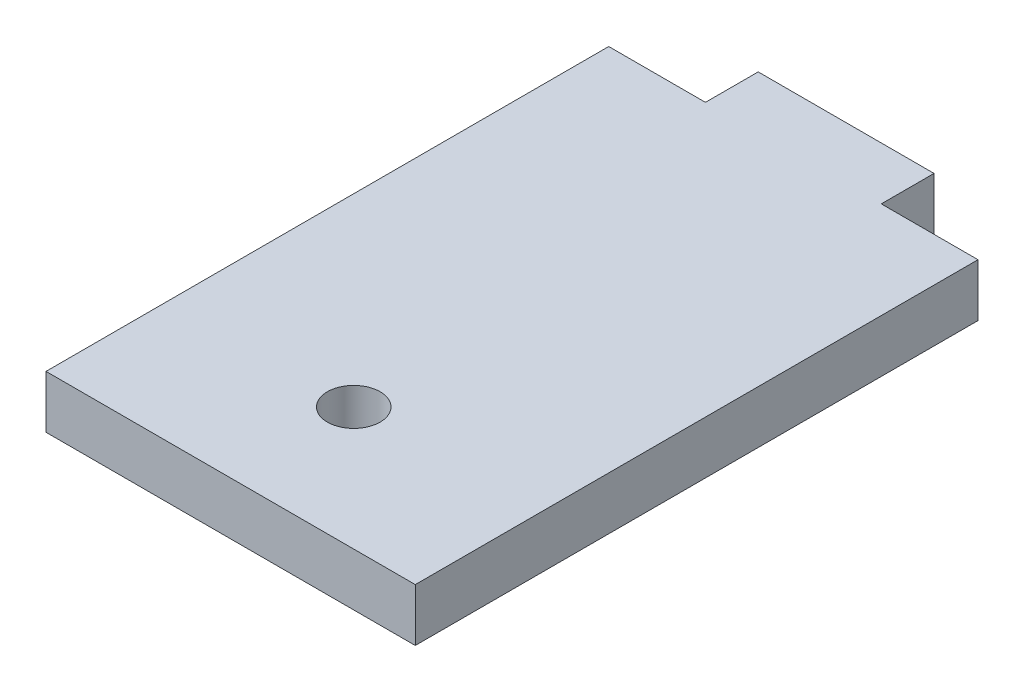
ISO-10303-21;
HEADER;
FILE_DESCRIPTION(('STEP AP214'),'2;1');
FILE_NAME('part.step','',(''),(''),'','','');
FILE_SCHEMA(('AUTOMOTIVE_DESIGN { 1 0 10303 214 1 1 1 1 }'));
ENDSEC;
DATA;
#1=APPLICATION_CONTEXT('core data for automotive mechanical design processes');
#2=APPLICATION_PROTOCOL_DEFINITION('international standard','automotive_design',2000,#1);
#3=PRODUCT_CONTEXT('',#1,'mechanical');
#4=PRODUCT('Part','Part','',(#3));
#5=PRODUCT_RELATED_PRODUCT_CATEGORY('part','',(#4));
#6=PRODUCT_DEFINITION_FORMATION('','',#4);
#7=PRODUCT_DEFINITION_CONTEXT('part definition',#1,'design');
#8=PRODUCT_DEFINITION('design','',#6,#7);
#9=PRODUCT_DEFINITION_SHAPE('','',#8);
#10=(LENGTH_UNIT() NAMED_UNIT(*) SI_UNIT(.MILLI.,.METRE.));
#11=(NAMED_UNIT(*) PLANE_ANGLE_UNIT() SI_UNIT($,.RADIAN.));
#12=(NAMED_UNIT(*) SI_UNIT($,.STERADIAN.) SOLID_ANGLE_UNIT());
#13=UNCERTAINTY_MEASURE_WITH_UNIT(LENGTH_MEASURE(1.E-05),#10,'distance_accuracy_value','');
#14=(GEOMETRIC_REPRESENTATION_CONTEXT(3) GLOBAL_UNCERTAINTY_ASSIGNED_CONTEXT((#13)) GLOBAL_UNIT_ASSIGNED_CONTEXT((#10,
#11,#12)) REPRESENTATION_CONTEXT('',''));
#15=CARTESIAN_POINT('',(0.,0.,0.));
#16=DIRECTION('',(0.,0.,1.));
#17=DIRECTION('',(1.,0.,0.));
#18=AXIS2_PLACEMENT_3D('',#15,#16,#17);
#19=CARTESIAN_POINT('',(0.,3.,0.));
#20=DIRECTION('',(0.,-1.,0.));
#21=DIRECTION('',(0.,0.,-1.));
#22=AXIS2_PLACEMENT_3D('',#19,#20,#21);
#23=PLANE('',#22);
#24=DIRECTION('',(0.,0.,1.));
#25=VECTOR('',#24,1.);
#26=CARTESIAN_POINT('',(0.,3.,3.));
#27=LINE('',#26,#25);
#28=CARTESIAN_POINT('',(0.,3.,0.));
#29=VERTEX_POINT('',#28);
#30=CARTESIAN_POINT('',(0.,3.,3.));
#31=VERTEX_POINT('',#30);
#32=EDGE_CURVE('E164',#29,#31,#27,.T.);
#33=ORIENTED_EDGE('',*,*,#32,.T.);
#34=DIRECTION('',(-1.,0.,0.));
#35=VECTOR('',#34,1.);
#36=CARTESIAN_POINT('',(-5.5,3.,3.));
#37=LINE('',#36,#35);
#38=CARTESIAN_POINT('',(-5.5,3.,3.));
#39=VERTEX_POINT('',#38);
#40=EDGE_CURVE('E100',#31,#39,#37,.T.);
#41=ORIENTED_EDGE('',*,*,#40,.T.);
#42=DIRECTION('',(0.,0.,1.));
#43=VECTOR('',#42,1.);
#44=CARTESIAN_POINT('',(-5.5,3.,35.));
#45=LINE('',#44,#43);
#46=CARTESIAN_POINT('',(-5.5,3.,35.));
#47=VERTEX_POINT('',#46);
#48=EDGE_CURVE('E185',#39,#47,#45,.T.);
#49=ORIENTED_EDGE('',*,*,#48,.T.);
#50=DIRECTION('',(1.,0.,0.));
#51=VECTOR('',#50,1.);
#52=CARTESIAN_POINT('',(15.5,3.,35.));
#53=LINE('',#52,#51);
#54=CARTESIAN_POINT('',(15.5,3.,35.));
#55=VERTEX_POINT('',#54);
#56=EDGE_CURVE('E199',#47,#55,#53,.T.);
#57=ORIENTED_EDGE('',*,*,#56,.T.);
#58=DIRECTION('',(0.,0.,-1.));
#59=VECTOR('',#58,1.);
#60=CARTESIAN_POINT('',(15.5,3.,3.));
#61=LINE('',#60,#59);
#62=CARTESIAN_POINT('',(15.5,3.,3.));
#63=VERTEX_POINT('',#62);
#64=EDGE_CURVE('E119',#55,#63,#61,.T.);
#65=ORIENTED_EDGE('',*,*,#64,.T.);
#66=DIRECTION('',(-1.,0.,0.));
#67=VECTOR('',#66,1.);
#68=CARTESIAN_POINT('',(10.,3.,3.));
#69=LINE('',#68,#67);
#70=CARTESIAN_POINT('',(10.,3.,3.));
#71=VERTEX_POINT('',#70);
#72=EDGE_CURVE('E113',#63,#71,#69,.T.);
#73=ORIENTED_EDGE('',*,*,#72,.T.);
#74=DIRECTION('',(0.,0.,-1.));
#75=VECTOR('',#74,1.);
#76=CARTESIAN_POINT('',(10.,3.,0.));
#77=LINE('',#76,#75);
#78=CARTESIAN_POINT('',(10.,3.,0.));
#79=VERTEX_POINT('',#78);
#80=EDGE_CURVE('E117',#71,#79,#77,.T.);
#81=ORIENTED_EDGE('',*,*,#80,.T.);
#82=DIRECTION('',(-1.,0.,0.));
#83=VECTOR('',#82,1.);
#84=CARTESIAN_POINT('',(0.,3.,0.));
#85=LINE('',#84,#83);
#86=EDGE_CURVE('E57',#79,#29,#85,.T.);
#87=ORIENTED_EDGE('',*,*,#86,.T.);
#88=EDGE_LOOP('',(#33,#41,#49,#57,#65,#73,#81,#87));
#89=FACE_BOUND('',#88,.T.);
#90=CARTESIAN_POINT('',(5.,3.,28.));
#91=DIRECTION('',(0.,1.,0.));
#92=DIRECTION('',(0.,0.,1.));
#93=AXIS2_PLACEMENT_3D('',#90,#91,#92);
#94=CIRCLE('',#93,1.5);
#95=CARTESIAN_POINT('',(5.,3.,29.5));
#96=VERTEX_POINT('',#95);
#97=EDGE_CURVE('E146',#96,#96,#94,.T.);
#98=ORIENTED_EDGE('',*,*,#97,.F.);
#99=EDGE_LOOP('',(#98));
#100=FACE_BOUND('',#99,.T.);
#101=ADVANCED_FACE('F39',(#89,#100),#23,.F.);
#102=CARTESIAN_POINT('',(0.,0.,0.));
#103=DIRECTION('',(0.,-1.,0.));
#104=DIRECTION('',(0.,0.,-1.));
#105=AXIS2_PLACEMENT_3D('',#102,#103,#104);
#106=PLANE('',#105);
#107=DIRECTION('',(0.,0.,1.));
#108=VECTOR('',#107,1.);
#109=CARTESIAN_POINT('',(0.,0.,3.));
#110=LINE('',#109,#108);
#111=CARTESIAN_POINT('',(0.,0.,0.));
#112=VERTEX_POINT('',#111);
#113=CARTESIAN_POINT('',(0.,0.,3.));
#114=VERTEX_POINT('',#113);
#115=EDGE_CURVE('E141',#112,#114,#110,.T.);
#116=ORIENTED_EDGE('',*,*,#115,.F.);
#117=DIRECTION('',(-1.,0.,0.));
#118=VECTOR('',#117,1.);
#119=CARTESIAN_POINT('',(0.,0.,0.));
#120=LINE('',#119,#118);
#121=CARTESIAN_POINT('',(10.,0.,0.));
#122=VERTEX_POINT('',#121);
#123=EDGE_CURVE('E92',#122,#112,#120,.T.);
#124=ORIENTED_EDGE('',*,*,#123,.F.);
#125=DIRECTION('',(0.,0.,-1.));
#126=VECTOR('',#125,1.);
#127=CARTESIAN_POINT('',(10.,0.,0.));
#128=LINE('',#127,#126);
#129=CARTESIAN_POINT('',(10.,0.,3.));
#130=VERTEX_POINT('',#129);
#131=EDGE_CURVE('E86',#130,#122,#128,.T.);
#132=ORIENTED_EDGE('',*,*,#131,.F.);
#133=DIRECTION('',(-1.,0.,0.));
#134=VECTOR('',#133,1.);
#135=CARTESIAN_POINT('',(10.,0.,3.));
#136=LINE('',#135,#134);
#137=CARTESIAN_POINT('',(15.5,0.,3.));
#138=VERTEX_POINT('',#137);
#139=EDGE_CURVE('E128',#138,#130,#136,.T.);
#140=ORIENTED_EDGE('',*,*,#139,.F.);
#141=DIRECTION('',(0.,0.,-1.));
#142=VECTOR('',#141,1.);
#143=CARTESIAN_POINT('',(15.5,0.,3.));
#144=LINE('',#143,#142);
#145=CARTESIAN_POINT('',(15.5,0.,35.));
#146=VERTEX_POINT('',#145);
#147=EDGE_CURVE('E155',#146,#138,#144,.T.);
#148=ORIENTED_EDGE('',*,*,#147,.F.);
#149=DIRECTION('',(1.,0.,0.));
#150=VECTOR('',#149,1.);
#151=CARTESIAN_POINT('',(15.5,0.,35.));
#152=LINE('',#151,#150);
#153=CARTESIAN_POINT('',(-5.5,0.,35.));
#154=VERTEX_POINT('',#153);
#155=EDGE_CURVE('E152',#154,#146,#152,.T.);
#156=ORIENTED_EDGE('',*,*,#155,.F.);
#157=DIRECTION('',(0.,0.,1.));
#158=VECTOR('',#157,1.);
#159=CARTESIAN_POINT('',(-5.5,0.,35.));
#160=LINE('',#159,#158);
#161=CARTESIAN_POINT('',(-5.5,0.,3.));
#162=VERTEX_POINT('',#161);
#163=EDGE_CURVE('E149',#162,#154,#160,.T.);
#164=ORIENTED_EDGE('',*,*,#163,.F.);
#165=DIRECTION('',(-1.,0.,0.));
#166=VECTOR('',#165,1.);
#167=CARTESIAN_POINT('',(-5.5,0.,3.));
#168=LINE('',#167,#166);
#169=EDGE_CURVE('E145',#114,#162,#168,.T.);
#170=ORIENTED_EDGE('',*,*,#169,.F.);
#171=EDGE_LOOP('',(#116,#124,#132,#140,#148,#156,#164,#170));
#172=FACE_BOUND('',#171,.T.);
#173=CARTESIAN_POINT('',(5.,0.,28.));
#174=DIRECTION('',(0.,1.,0.));
#175=DIRECTION('',(0.,0.,1.));
#176=AXIS2_PLACEMENT_3D('',#173,#174,#175);
#177=CIRCLE('',#176,1.5);
#178=CARTESIAN_POINT('',(5.,0.,29.5));
#179=VERTEX_POINT('',#178);
#180=EDGE_CURVE('E209',#179,#179,#177,.T.);
#181=ORIENTED_EDGE('',*,*,#180,.T.);
#182=EDGE_LOOP('',(#181));
#183=FACE_BOUND('',#182,.T.);
#184=ADVANCED_FACE('F189',(#172,#183),#106,.T.);
#185=CARTESIAN_POINT('',(0.,3.,3.));
#186=DIRECTION('',(1.,0.,0.));
#187=DIRECTION('',(0.,0.,-1.));
#188=AXIS2_PLACEMENT_3D('',#185,#186,#187);
#189=PLANE('',#188);
#190=ORIENTED_EDGE('',*,*,#115,.T.);
#191=DIRECTION('',(0.,-1.,0.));
#192=VECTOR('',#191,1.);
#193=CARTESIAN_POINT('',(0.,3.,3.));
#194=LINE('',#193,#192);
#195=EDGE_CURVE('E11',#31,#114,#194,.T.);
#196=ORIENTED_EDGE('',*,*,#195,.F.);
#197=ORIENTED_EDGE('',*,*,#32,.F.);
#198=DIRECTION('',(0.,-1.,0.));
#199=VECTOR('',#198,1.);
#200=CARTESIAN_POINT('',(0.,3.,0.));
#201=LINE('',#200,#199);
#202=EDGE_CURVE('E137',#29,#112,#201,.T.);
#203=ORIENTED_EDGE('',*,*,#202,.T.);
#204=EDGE_LOOP('',(#190,#196,#197,#203));
#205=FACE_BOUND('',#204,.T.);
#206=ADVANCED_FACE('F41',(#205),#189,.F.);
#207=CARTESIAN_POINT('',(-5.5,3.,3.));
#208=DIRECTION('',(0.,0.,1.));
#209=DIRECTION('',(1.,0.,0.));
#210=AXIS2_PLACEMENT_3D('',#207,#208,#209);
#211=PLANE('',#210);
#212=ORIENTED_EDGE('',*,*,#169,.T.);
#213=DIRECTION('',(0.,-1.,0.));
#214=VECTOR('',#213,1.);
#215=CARTESIAN_POINT('',(-5.5,3.,3.));
#216=LINE('',#215,#214);
#217=EDGE_CURVE('E49',#39,#162,#216,.T.);
#218=ORIENTED_EDGE('',*,*,#217,.F.);
#219=ORIENTED_EDGE('',*,*,#40,.F.);
#220=ORIENTED_EDGE('',*,*,#195,.T.);
#221=EDGE_LOOP('',(#212,#218,#219,#220));
#222=FACE_BOUND('',#221,.T.);
#223=ADVANCED_FACE('F239',(#222),#211,.F.);
#224=CARTESIAN_POINT('',(-5.5,3.,35.));
#225=DIRECTION('',(1.,0.,0.));
#226=DIRECTION('',(0.,0.,-1.));
#227=AXIS2_PLACEMENT_3D('',#224,#225,#226);
#228=PLANE('',#227);
#229=ORIENTED_EDGE('',*,*,#163,.T.);
#230=DIRECTION('',(0.,-1.,0.));
#231=VECTOR('',#230,1.);
#232=CARTESIAN_POINT('',(-5.5,3.,35.));
#233=LINE('',#232,#231);
#234=EDGE_CURVE('E175',#47,#154,#233,.T.);
#235=ORIENTED_EDGE('',*,*,#234,.F.);
#236=ORIENTED_EDGE('',*,*,#48,.F.);
#237=ORIENTED_EDGE('',*,*,#217,.T.);
#238=EDGE_LOOP('',(#229,#235,#236,#237));
#239=FACE_BOUND('',#238,.T.);
#240=ADVANCED_FACE('F183',(#239),#228,.F.);
#241=CARTESIAN_POINT('',(15.5,3.,35.));
#242=DIRECTION('',(0.,0.,-1.));
#243=DIRECTION('',(-1.,0.,0.));
#244=AXIS2_PLACEMENT_3D('',#241,#242,#243);
#245=PLANE('',#244);
#246=ORIENTED_EDGE('',*,*,#155,.T.);
#247=DIRECTION('',(0.,-1.,0.));
#248=VECTOR('',#247,1.);
#249=CARTESIAN_POINT('',(15.5,3.,35.));
#250=LINE('',#249,#248);
#251=EDGE_CURVE('E171',#55,#146,#250,.T.);
#252=ORIENTED_EDGE('',*,*,#251,.F.);
#253=ORIENTED_EDGE('',*,*,#56,.F.);
#254=ORIENTED_EDGE('',*,*,#234,.T.);
#255=EDGE_LOOP('',(#246,#252,#253,#254));
#256=FACE_BOUND('',#255,.T.);
#257=ADVANCED_FACE('F194',(#256),#245,.F.);
#258=CARTESIAN_POINT('',(15.5,3.,3.));
#259=DIRECTION('',(-1.,0.,0.));
#260=DIRECTION('',(0.,0.,1.));
#261=AXIS2_PLACEMENT_3D('',#258,#259,#260);
#262=PLANE('',#261);
#263=ORIENTED_EDGE('',*,*,#147,.T.);
#264=DIRECTION('',(0.,-1.,0.));
#265=VECTOR('',#264,1.);
#266=CARTESIAN_POINT('',(15.5,3.,3.));
#267=LINE('',#266,#265);
#268=EDGE_CURVE('E130',#63,#138,#267,.T.);
#269=ORIENTED_EDGE('',*,*,#268,.F.);
#270=ORIENTED_EDGE('',*,*,#64,.F.);
#271=ORIENTED_EDGE('',*,*,#251,.T.);
#272=EDGE_LOOP('',(#263,#269,#270,#271));
#273=FACE_BOUND('',#272,.T.);
#274=ADVANCED_FACE('F197',(#273),#262,.F.);
#275=CARTESIAN_POINT('',(10.,3.,3.));
#276=DIRECTION('',(0.,0.,1.));
#277=DIRECTION('',(1.,0.,0.));
#278=AXIS2_PLACEMENT_3D('',#275,#276,#277);
#279=PLANE('',#278);
#280=ORIENTED_EDGE('',*,*,#139,.T.);
#281=DIRECTION('',(0.,-1.,0.));
#282=VECTOR('',#281,1.);
#283=CARTESIAN_POINT('',(10.,3.,3.));
#284=LINE('',#283,#282);
#285=EDGE_CURVE('E125',#71,#130,#284,.T.);
#286=ORIENTED_EDGE('',*,*,#285,.F.);
#287=ORIENTED_EDGE('',*,*,#72,.F.);
#288=ORIENTED_EDGE('',*,*,#268,.T.);
#289=EDGE_LOOP('',(#280,#286,#287,#288));
#290=FACE_BOUND('',#289,.T.);
#291=ADVANCED_FACE('F126',(#290),#279,.F.);
#292=CARTESIAN_POINT('',(10.,3.,0.));
#293=DIRECTION('',(-1.,0.,0.));
#294=DIRECTION('',(0.,0.,1.));
#295=AXIS2_PLACEMENT_3D('',#292,#293,#294);
#296=PLANE('',#295);
#297=ORIENTED_EDGE('',*,*,#131,.T.);
#298=DIRECTION('',(0.,-1.,0.));
#299=VECTOR('',#298,1.);
#300=CARTESIAN_POINT('',(10.,3.,0.));
#301=LINE('',#300,#299);
#302=EDGE_CURVE('E131',#79,#122,#301,.T.);
#303=ORIENTED_EDGE('',*,*,#302,.F.);
#304=ORIENTED_EDGE('',*,*,#80,.F.);
#305=ORIENTED_EDGE('',*,*,#285,.T.);
#306=EDGE_LOOP('',(#297,#303,#304,#305));
#307=FACE_BOUND('',#306,.T.);
#308=ADVANCED_FACE('F133',(#307),#296,.F.);
#309=CARTESIAN_POINT('',(0.,3.,0.));
#310=DIRECTION('',(0.,0.,1.));
#311=DIRECTION('',(1.,0.,0.));
#312=AXIS2_PLACEMENT_3D('',#309,#310,#311);
#313=PLANE('',#312);
#314=ORIENTED_EDGE('',*,*,#123,.T.);
#315=ORIENTED_EDGE('',*,*,#202,.F.);
#316=ORIENTED_EDGE('',*,*,#86,.F.);
#317=ORIENTED_EDGE('',*,*,#302,.T.);
#318=EDGE_LOOP('',(#314,#315,#316,#317));
#319=FACE_BOUND('',#318,.T.);
#320=ADVANCED_FACE('F227',(#319),#313,.F.);
#321=CARTESIAN_POINT('',(5.,3.,28.));
#322=DIRECTION('',(0.,-1.,0.));
#323=DIRECTION('',(0.,0.,-1.));
#324=AXIS2_PLACEMENT_3D('',#321,#322,#323);
#325=CYLINDRICAL_SURFACE('',#324,1.5);
#326=ORIENTED_EDGE('',*,*,#97,.T.);
#327=EDGE_LOOP('',(#326));
#328=FACE_BOUND('',#327,.T.);
#329=ORIENTED_EDGE('',*,*,#180,.F.);
#330=EDGE_LOOP('',(#329));
#331=FACE_BOUND('',#330,.T.);
#332=ADVANCED_FACE('F217',(#328,#331),#325,.F.);
#333=CLOSED_SHELL('',(#101,#184,#206,#223,#240,#257,#274,#291,#308,#320,#332));
#334=MANIFOLD_SOLID_BREP('B2',#333);
#335=ADVANCED_BREP_SHAPE_REPRESENTATION('',(#18,#334),#14);
#336=SHAPE_DEFINITION_REPRESENTATION(#9,#335);
ENDSEC;
END-ISO-10303-21;
